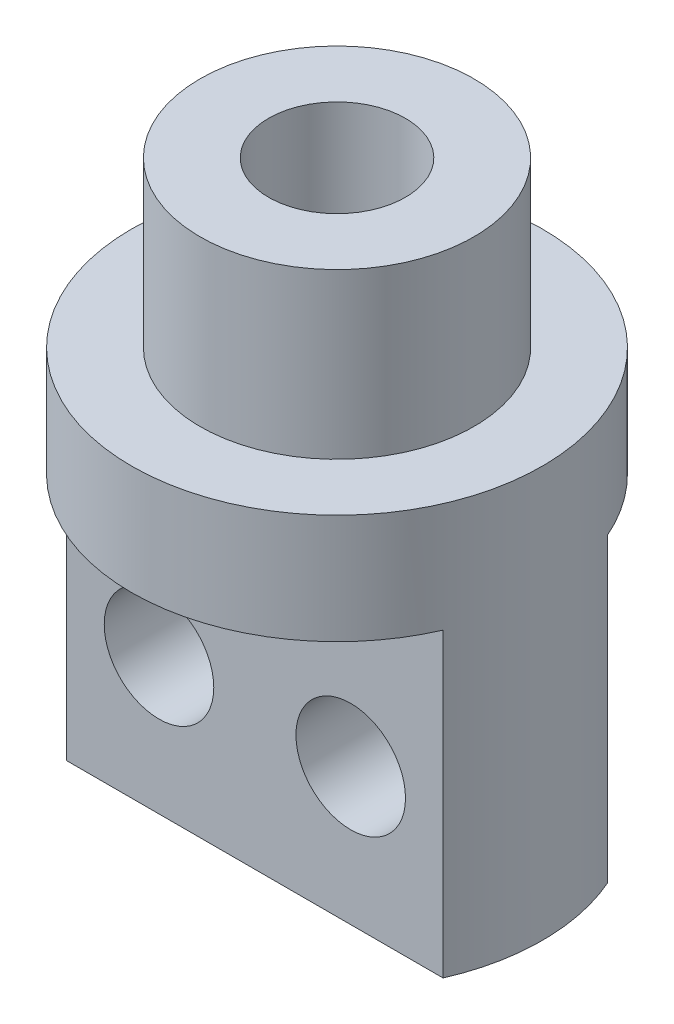
ISO-10303-21;
HEADER;
FILE_DESCRIPTION(('STEP AP214'),'2;1');
FILE_NAME('part.step','',(''),(''),'','','');
FILE_SCHEMA(('AUTOMOTIVE_DESIGN { 1 0 10303 214 1 1 1 1 }'));
ENDSEC;
DATA;
#1=APPLICATION_CONTEXT('core data for automotive mechanical design processes');
#2=APPLICATION_PROTOCOL_DEFINITION('international standard','automotive_design',2000,#1);
#3=PRODUCT_CONTEXT('',#1,'mechanical');
#4=PRODUCT('Part','Part','',(#3));
#5=PRODUCT_RELATED_PRODUCT_CATEGORY('part','',(#4));
#6=PRODUCT_DEFINITION_FORMATION('','',#4);
#7=PRODUCT_DEFINITION_CONTEXT('part definition',#1,'design');
#8=PRODUCT_DEFINITION('design','',#6,#7);
#9=PRODUCT_DEFINITION_SHAPE('','',#8);
#10=(LENGTH_UNIT() NAMED_UNIT(*) SI_UNIT(.MILLI.,.METRE.));
#11=(NAMED_UNIT(*) PLANE_ANGLE_UNIT() SI_UNIT($,.RADIAN.));
#12=(NAMED_UNIT(*) SI_UNIT($,.STERADIAN.) SOLID_ANGLE_UNIT());
#13=UNCERTAINTY_MEASURE_WITH_UNIT(LENGTH_MEASURE(1.E-05),#10,'distance_accuracy_value','');
#14=(GEOMETRIC_REPRESENTATION_CONTEXT(3) GLOBAL_UNCERTAINTY_ASSIGNED_CONTEXT((#13)) GLOBAL_UNIT_ASSIGNED_CONTEXT((#10,
#11,#12)) REPRESENTATION_CONTEXT('',''));
#15=CARTESIAN_POINT('',(0.,0.,0.));
#16=DIRECTION('',(0.,0.,1.));
#17=DIRECTION('',(1.,0.,0.));
#18=AXIS2_PLACEMENT_3D('',#15,#16,#17);
#19=CARTESIAN_POINT('',(0.,30.,5.));
#20=DIRECTION('',(0.,-1.,0.));
#21=DIRECTION('',(1.,0.,0.));
#22=AXIS2_PLACEMENT_3D('',#19,#20,#21);
#23=CYLINDRICAL_SURFACE('',#22,7.5);
#24=CARTESIAN_POINT('',(0.,30.,5.));
#25=DIRECTION('',(0.,1.,0.));
#26=DIRECTION('',(-1.,0.,0.));
#27=AXIS2_PLACEMENT_3D('',#24,#25,#26);
#28=CIRCLE('',#27,7.5);
#29=CARTESIAN_POINT('',(-7.5,30.,5.));
#30=VERTEX_POINT('',#29);
#31=EDGE_CURVE('E88',#30,#30,#28,.T.);
#32=ORIENTED_EDGE('',*,*,#31,.F.);
#33=EDGE_LOOP('',(#32));
#34=FACE_BOUND('',#33,.T.);
#35=DIRECTION('',(0.,-1.,0.));
#36=VECTOR('',#35,1.);
#37=CARTESIAN_POINT('',(6.87386354243376,30.,2.));
#38=LINE('',#37,#36);
#39=CARTESIAN_POINT('',(6.87386354243376,26.,2.));
#40=VERTEX_POINT('',#39);
#41=CARTESIAN_POINT('',(6.87386354243376,15.,2.));
#42=VERTEX_POINT('',#41);
#43=EDGE_CURVE('E55',#40,#42,#38,.T.);
#44=ORIENTED_EDGE('',*,*,#43,.F.);
#45=CARTESIAN_POINT('',(0.,26.,5.));
#46=DIRECTION('',(0.,-1.,0.));
#47=DIRECTION('',(1.,0.,0.));
#48=AXIS2_PLACEMENT_3D('',#45,#46,#47);
#49=CIRCLE('',#48,7.5);
#50=CARTESIAN_POINT('',(-6.87386354243376,26.,2.));
#51=VERTEX_POINT('',#50);
#52=EDGE_CURVE('E48',#51,#40,#49,.T.);
#53=ORIENTED_EDGE('',*,*,#52,.F.);
#54=DIRECTION('',(0.,-1.,0.));
#55=VECTOR('',#54,1.);
#56=CARTESIAN_POINT('',(-6.87386354243376,30.,2.));
#57=LINE('',#56,#55);
#58=CARTESIAN_POINT('',(-6.87386354243376,15.,2.));
#59=VERTEX_POINT('',#58);
#60=EDGE_CURVE('E110',#59,#51,#57,.F.);
#61=ORIENTED_EDGE('',*,*,#60,.F.);
#62=CARTESIAN_POINT('',(0.,15.,5.));
#63=DIRECTION('',(0.,1.,0.));
#64=DIRECTION('',(-1.,0.,0.));
#65=AXIS2_PLACEMENT_3D('',#62,#63,#64);
#66=CIRCLE('',#65,7.5);
#67=CARTESIAN_POINT('',(-6.87386354243376,15.,8.));
#68=VERTEX_POINT('',#67);
#69=EDGE_CURVE('E98',#59,#68,#66,.T.);
#70=ORIENTED_EDGE('',*,*,#69,.T.);
#71=DIRECTION('',(0.,-1.,0.));
#72=VECTOR('',#71,1.);
#73=CARTESIAN_POINT('',(-6.87386354243376,30.,8.));
#74=LINE('',#73,#72);
#75=CARTESIAN_POINT('',(-6.87386354243376,26.,8.));
#76=VERTEX_POINT('',#75);
#77=EDGE_CURVE('E63',#76,#68,#74,.T.);
#78=ORIENTED_EDGE('',*,*,#77,.F.);
#79=CARTESIAN_POINT('',(0.,26.,5.));
#80=DIRECTION('',(0.,-1.,0.));
#81=DIRECTION('',(1.,0.,0.));
#82=AXIS2_PLACEMENT_3D('',#79,#80,#81);
#83=CIRCLE('',#82,7.5);
#84=CARTESIAN_POINT('',(6.87386354243376,26.,8.));
#85=VERTEX_POINT('',#84);
#86=EDGE_CURVE('E83',#85,#76,#83,.T.);
#87=ORIENTED_EDGE('',*,*,#86,.F.);
#88=DIRECTION('',(0.,-1.,0.));
#89=VECTOR('',#88,1.);
#90=CARTESIAN_POINT('',(6.87386354243376,30.,8.));
#91=LINE('',#90,#89);
#92=CARTESIAN_POINT('',(6.87386354243377,15.,8.));
#93=VERTEX_POINT('',#92);
#94=EDGE_CURVE('E91',#93,#85,#91,.F.);
#95=ORIENTED_EDGE('',*,*,#94,.F.);
#96=EDGE_CURVE('E115',#93,#42,#66,.T.);
#97=ORIENTED_EDGE('',*,*,#96,.T.);
#98=EDGE_LOOP('',(#44,#53,#61,#70,#78,#87,#95,#97));
#99=FACE_BOUND('',#98,.T.);
#100=ADVANCED_FACE('F41',(#34,#99),#23,.T.);
#101=CARTESIAN_POINT('',(0.,15.,5.));
#102=DIRECTION('',(0.,1.,0.));
#103=DIRECTION('',(-1.,0.,0.));
#104=AXIS2_PLACEMENT_3D('',#101,#102,#103);
#105=PLANE('',#104);
#106=DIRECTION('',(1.,0.,0.));
#107=VECTOR('',#106,1.);
#108=CARTESIAN_POINT('',(-9.05136645581642,15.,2.));
#109=LINE('',#108,#107);
#110=EDGE_CURVE('E92',#59,#42,#109,.T.);
#111=ORIENTED_EDGE('',*,*,#110,.T.);
#112=ORIENTED_EDGE('',*,*,#96,.F.);
#113=DIRECTION('',(-1.,0.,0.));
#114=VECTOR('',#113,1.);
#115=CARTESIAN_POINT('',(-9.05136645581642,15.,8.));
#116=LINE('',#115,#114);
#117=EDGE_CURVE('E93',#93,#68,#116,.T.);
#118=ORIENTED_EDGE('',*,*,#117,.T.);
#119=ORIENTED_EDGE('',*,*,#69,.F.);
#120=EDGE_LOOP('',(#111,#112,#118,#119));
#121=FACE_BOUND('',#120,.T.);
#122=ADVANCED_FACE('F129',(#121),#105,.F.);
#123=CARTESIAN_POINT('',(0.,30.,5.));
#124=DIRECTION('',(0.,1.,0.));
#125=DIRECTION('',(-1.,0.,0.));
#126=AXIS2_PLACEMENT_3D('',#123,#124,#125);
#127=PLANE('',#126);
#128=CARTESIAN_POINT('',(0.,30.,5.));
#129=DIRECTION('',(0.,1.,0.));
#130=DIRECTION('',(-1.,0.,0.));
#131=AXIS2_PLACEMENT_3D('',#128,#129,#130);
#132=CIRCLE('',#131,5.);
#133=CARTESIAN_POINT('',(-5.,30.,5.));
#134=VERTEX_POINT('',#133);
#135=EDGE_CURVE('E206',#134,#134,#132,.T.);
#136=ORIENTED_EDGE('',*,*,#135,.F.);
#137=EDGE_LOOP('',(#136));
#138=FACE_BOUND('',#137,.T.);
#139=ORIENTED_EDGE('',*,*,#31,.T.);
#140=EDGE_LOOP('',(#139));
#141=FACE_BOUND('',#140,.T.);
#142=ADVANCED_FACE('F160',(#138,#141),#127,.T.);
#143=CARTESIAN_POINT('',(0.,26.,10.));
#144=DIRECTION('',(0.,-1.,0.));
#145=DIRECTION('',(1.,0.,0.));
#146=AXIS2_PLACEMENT_3D('',#143,#144,#145);
#147=PLANE('',#146);
#148=ORIENTED_EDGE('',*,*,#86,.T.);
#149=DIRECTION('',(1.,0.,0.));
#150=VECTOR('',#149,1.);
#151=CARTESIAN_POINT('',(-9.05136645581642,26.,8.));
#152=LINE('',#151,#150);
#153=EDGE_CURVE('E85',#76,#85,#152,.T.);
#154=ORIENTED_EDGE('',*,*,#153,.T.);
#155=EDGE_LOOP('',(#148,#154));
#156=FACE_BOUND('',#155,.T.);
#157=ADVANCED_FACE('F84',(#156),#147,.T.);
#158=CARTESIAN_POINT('',(-9.05136645581643,47.6811251838461,8.));
#159=DIRECTION('',(0.,0.,1.));
#160=DIRECTION('',(1.,0.,0.));
#161=AXIS2_PLACEMENT_3D('',#158,#159,#160);
#162=PLANE('',#161);
#163=CARTESIAN_POINT('',(-3.5,20.,8.00000000000001));
#164=DIRECTION('',(0.,0.,1.));
#165=DIRECTION('',(1.,0.,0.));
#166=AXIS2_PLACEMENT_3D('',#163,#164,#165);
#167=CIRCLE('',#166,2.);
#168=CARTESIAN_POINT('',(-1.5,20.,8.00000000000001));
#169=VERTEX_POINT('',#168);
#170=EDGE_CURVE('E117',#169,#169,#167,.F.);
#171=ORIENTED_EDGE('',*,*,#170,.T.);
#172=EDGE_LOOP('',(#171));
#173=FACE_BOUND('',#172,.T.);
#174=CARTESIAN_POINT('',(3.5,20.,8.00000000000001));
#175=DIRECTION('',(0.,0.,1.));
#176=DIRECTION('',(1.,0.,0.));
#177=AXIS2_PLACEMENT_3D('',#174,#175,#176);
#178=CIRCLE('',#177,2.);
#179=CARTESIAN_POINT('',(5.5,20.,8.00000000000001));
#180=VERTEX_POINT('',#179);
#181=EDGE_CURVE('E104',#180,#180,#178,.F.);
#182=ORIENTED_EDGE('',*,*,#181,.T.);
#183=EDGE_LOOP('',(#182));
#184=FACE_BOUND('',#183,.T.);
#185=ORIENTED_EDGE('',*,*,#77,.T.);
#186=ORIENTED_EDGE('',*,*,#117,.F.);
#187=ORIENTED_EDGE('',*,*,#94,.T.);
#188=ORIENTED_EDGE('',*,*,#153,.F.);
#189=EDGE_LOOP('',(#185,#186,#187,#188));
#190=FACE_BOUND('',#189,.T.);
#191=ADVANCED_FACE('F90',(#173,#184,#190),#162,.T.);
#192=CARTESIAN_POINT('',(0.,26.,10.));
#193=DIRECTION('',(0.,-1.,0.));
#194=DIRECTION('',(1.,0.,0.));
#195=AXIS2_PLACEMENT_3D('',#192,#193,#194);
#196=PLANE('',#195);
#197=ORIENTED_EDGE('',*,*,#52,.T.);
#198=DIRECTION('',(-1.,0.,0.));
#199=VECTOR('',#198,1.);
#200=CARTESIAN_POINT('',(-9.05136645581642,26.,2.));
#201=LINE('',#200,#199);
#202=EDGE_CURVE('E119',#40,#51,#201,.T.);
#203=ORIENTED_EDGE('',*,*,#202,.T.);
#204=EDGE_LOOP('',(#197,#203));
#205=FACE_BOUND('',#204,.T.);
#206=ADVANCED_FACE('F123',(#205),#196,.T.);
#207=CARTESIAN_POINT('',(-9.05136645581643,47.6811251838461,2.));
#208=DIRECTION('',(0.,0.,-1.));
#209=DIRECTION('',(-1.,0.,0.));
#210=AXIS2_PLACEMENT_3D('',#207,#208,#209);
#211=PLANE('',#210);
#212=CARTESIAN_POINT('',(-3.5,20.,2.));
#213=DIRECTION('',(0.,0.,-1.));
#214=DIRECTION('',(-1.,0.,0.));
#215=AXIS2_PLACEMENT_3D('',#212,#213,#214);
#216=CIRCLE('',#215,2.);
#217=CARTESIAN_POINT('',(-5.5,20.,2.));
#218=VERTEX_POINT('',#217);
#219=EDGE_CURVE('E99',#218,#218,#216,.F.);
#220=ORIENTED_EDGE('',*,*,#219,.T.);
#221=EDGE_LOOP('',(#220));
#222=FACE_BOUND('',#221,.T.);
#223=CARTESIAN_POINT('',(3.5,20.,2.));
#224=DIRECTION('',(0.,0.,-1.));
#225=DIRECTION('',(-1.,0.,0.));
#226=AXIS2_PLACEMENT_3D('',#223,#224,#225);
#227=CIRCLE('',#226,2.);
#228=CARTESIAN_POINT('',(1.5,20.,2.));
#229=VERTEX_POINT('',#228);
#230=EDGE_CURVE('E102',#229,#229,#227,.F.);
#231=ORIENTED_EDGE('',*,*,#230,.T.);
#232=EDGE_LOOP('',(#231));
#233=FACE_BOUND('',#232,.T.);
#234=ORIENTED_EDGE('',*,*,#43,.T.);
#235=ORIENTED_EDGE('',*,*,#110,.F.);
#236=ORIENTED_EDGE('',*,*,#60,.T.);
#237=ORIENTED_EDGE('',*,*,#202,.F.);
#238=EDGE_LOOP('',(#234,#235,#236,#237));
#239=FACE_BOUND('',#238,.T.);
#240=ADVANCED_FACE('F124',(#222,#233,#239),#211,.T.);
#241=CARTESIAN_POINT('',(3.50000000000002,20.,274.));
#242=DIRECTION('',(0.,0.,-1.));
#243=DIRECTION('',(-1.,0.,0.));
#244=AXIS2_PLACEMENT_3D('',#241,#242,#243);
#245=CYLINDRICAL_SURFACE('',#244,2.);
#246=ORIENTED_EDGE('',*,*,#181,.F.);
#247=EDGE_LOOP('',(#246));
#248=FACE_BOUND('',#247,.T.);
#249=ORIENTED_EDGE('',*,*,#230,.F.);
#250=EDGE_LOOP('',(#249));
#251=FACE_BOUND('',#250,.T.);
#252=ADVANCED_FACE('F138',(#248,#251),#245,.F.);
#253=CARTESIAN_POINT('',(-3.49999999999998,20.,274.));
#254=DIRECTION('',(0.,0.,-1.));
#255=DIRECTION('',(-1.,0.,0.));
#256=AXIS2_PLACEMENT_3D('',#253,#254,#255);
#257=CYLINDRICAL_SURFACE('',#256,2.);
#258=ORIENTED_EDGE('',*,*,#170,.F.);
#259=EDGE_LOOP('',(#258));
#260=FACE_BOUND('',#259,.T.);
#261=ORIENTED_EDGE('',*,*,#219,.F.);
#262=EDGE_LOOP('',(#261));
#263=FACE_BOUND('',#262,.T.);
#264=ADVANCED_FACE('F141',(#260,#263),#257,.F.);
#265=CARTESIAN_POINT('',(0.,36.,5.));
#266=DIRECTION('',(0.,1.,0.));
#267=DIRECTION('',(-1.,0.,0.));
#268=AXIS2_PLACEMENT_3D('',#265,#266,#267);
#269=PLANE('',#268);
#270=CARTESIAN_POINT('',(0.,36.,5.));
#271=DIRECTION('',(0.,1.,0.));
#272=DIRECTION('',(-1.,0.,0.));
#273=AXIS2_PLACEMENT_3D('',#270,#271,#272);
#274=CIRCLE('',#273,5.);
#275=CARTESIAN_POINT('',(-5.00000000000001,36.,5.));
#276=VERTEX_POINT('',#275);
#277=EDGE_CURVE('E133',#276,#276,#274,.T.);
#278=ORIENTED_EDGE('',*,*,#277,.T.);
#279=EDGE_LOOP('',(#278));
#280=FACE_BOUND('',#279,.T.);
#281=CARTESIAN_POINT('',(0.,36.,5.));
#282=DIRECTION('',(0.,1.,0.));
#283=DIRECTION('',(-1.,0.,0.));
#284=AXIS2_PLACEMENT_3D('',#281,#282,#283);
#285=CIRCLE('',#284,2.5);
#286=CARTESIAN_POINT('',(-2.5,36.,5.));
#287=VERTEX_POINT('',#286);
#288=EDGE_CURVE('E205',#287,#287,#285,.T.);
#289=ORIENTED_EDGE('',*,*,#288,.F.);
#290=EDGE_LOOP('',(#289));
#291=FACE_BOUND('',#290,.T.);
#292=ADVANCED_FACE('F188',(#280,#291),#269,.T.);
#293=CARTESIAN_POINT('',(0.,36.,5.));
#294=DIRECTION('',(0.,-1.,0.));
#295=DIRECTION('',(1.,0.,0.));
#296=AXIS2_PLACEMENT_3D('',#293,#294,#295);
#297=CYLINDRICAL_SURFACE('',#296,5.);
#298=ORIENTED_EDGE('',*,*,#277,.F.);
#299=EDGE_LOOP('',(#298));
#300=FACE_BOUND('',#299,.T.);
#301=ORIENTED_EDGE('',*,*,#135,.T.);
#302=EDGE_LOOP('',(#301));
#303=FACE_BOUND('',#302,.T.);
#304=ADVANCED_FACE('F179',(#300,#303),#297,.T.);
#305=CARTESIAN_POINT('',(0.,36.,5.));
#306=DIRECTION('',(0.,-1.,0.));
#307=DIRECTION('',(1.,0.,0.));
#308=AXIS2_PLACEMENT_3D('',#305,#306,#307);
#309=CYLINDRICAL_SURFACE('',#308,2.5);
#310=ORIENTED_EDGE('',*,*,#288,.T.);
#311=EDGE_LOOP('',(#310));
#312=FACE_BOUND('',#311,.T.);
#313=CARTESIAN_POINT('',(0.,30.,5.));
#314=DIRECTION('',(0.,1.,0.));
#315=DIRECTION('',(-1.,0.,0.));
#316=AXIS2_PLACEMENT_3D('',#313,#314,#315);
#317=CIRCLE('',#316,2.5);
#318=CARTESIAN_POINT('',(-2.5,30.,5.));
#319=VERTEX_POINT('',#318);
#320=EDGE_CURVE('E11',#319,#319,#317,.F.);
#321=ORIENTED_EDGE('',*,*,#320,.T.);
#322=EDGE_LOOP('',(#321));
#323=FACE_BOUND('',#322,.T.);
#324=ADVANCED_FACE('F173',(#312,#323),#309,.F.);
#325=ORIENTED_EDGE('',*,*,#320,.F.);
#326=EDGE_LOOP('',(#325));
#327=FACE_BOUND('',#326,.T.);
#328=ADVANCED_FACE('F166',(#327),#127,.T.);
#329=CLOSED_SHELL('',(#100,#122,#142,#157,#191,#206,#240,#252,#264,#292,#304,#324,#328));
#330=MANIFOLD_SOLID_BREP('B2',#329);
#331=ADVANCED_BREP_SHAPE_REPRESENTATION('',(#18,#330),#14);
#332=SHAPE_DEFINITION_REPRESENTATION(#9,#331);
ENDSEC;
END-ISO-10303-21;
